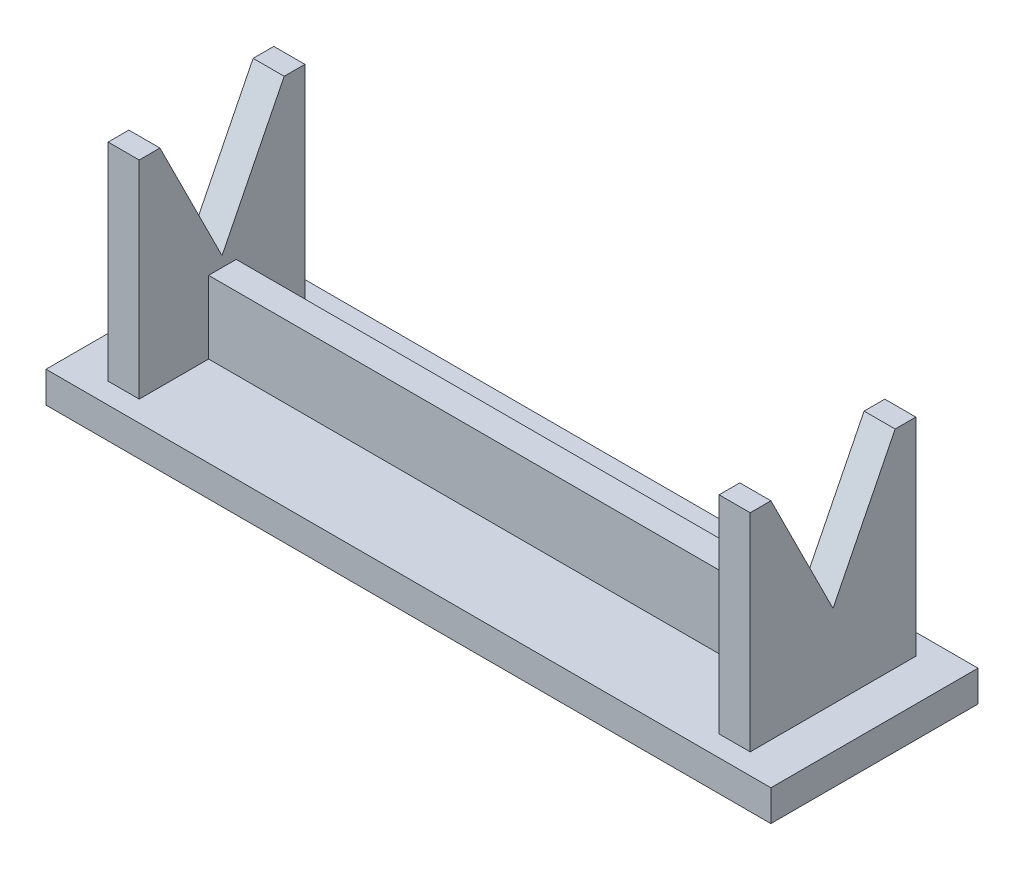
ISO-10303-21;
HEADER;
FILE_DESCRIPTION(('STEP AP214'),'2;1');
FILE_NAME('part.step','',(''),(''),'','','');
FILE_SCHEMA(('AUTOMOTIVE_DESIGN { 1 0 10303 214 1 1 1 1 }'));
ENDSEC;
DATA;
#1=APPLICATION_CONTEXT('core data for automotive mechanical design processes');
#2=APPLICATION_PROTOCOL_DEFINITION('international standard','automotive_design',2000,#1);
#3=PRODUCT_CONTEXT('',#1,'mechanical');
#4=PRODUCT('Part','Part','',(#3));
#5=PRODUCT_RELATED_PRODUCT_CATEGORY('part','',(#4));
#6=PRODUCT_DEFINITION_FORMATION('','',#4);
#7=PRODUCT_DEFINITION_CONTEXT('part definition',#1,'design');
#8=PRODUCT_DEFINITION('design','',#6,#7);
#9=PRODUCT_DEFINITION_SHAPE('','',#8);
#10=(LENGTH_UNIT() NAMED_UNIT(*) SI_UNIT(.MILLI.,.METRE.));
#11=(NAMED_UNIT(*) PLANE_ANGLE_UNIT() SI_UNIT($,.RADIAN.));
#12=(NAMED_UNIT(*) SI_UNIT($,.STERADIAN.) SOLID_ANGLE_UNIT());
#13=UNCERTAINTY_MEASURE_WITH_UNIT(LENGTH_MEASURE(1.E-05),#10,'distance_accuracy_value','');
#14=(GEOMETRIC_REPRESENTATION_CONTEXT(3) GLOBAL_UNCERTAINTY_ASSIGNED_CONTEXT((#13)) GLOBAL_UNIT_ASSIGNED_CONTEXT((#10,
#11,#12)) REPRESENTATION_CONTEXT('',''));
#15=CARTESIAN_POINT('',(0.,0.,0.));
#16=DIRECTION('',(0.,0.,1.));
#17=DIRECTION('',(1.,0.,0.));
#18=AXIS2_PLACEMENT_3D('',#15,#16,#17);
#19=CARTESIAN_POINT('',(0.,3.,0.));
#20=DIRECTION('',(0.,-1.,0.));
#21=DIRECTION('',(0.,0.,-1.));
#22=AXIS2_PLACEMENT_3D('',#19,#20,#21);
#23=PLANE('',#22);
#24=DIRECTION('',(0.,0.,1.));
#25=VECTOR('',#24,1.);
#26=CARTESIAN_POINT('',(0.,3.,0.));
#27=LINE('',#26,#25);
#28=CARTESIAN_POINT('',(0.,3.,-20.));
#29=VERTEX_POINT('',#28);
#30=CARTESIAN_POINT('',(0.,3.,0.));
#31=VERTEX_POINT('',#30);
#32=EDGE_CURVE('E363',#29,#31,#27,.T.);
#33=ORIENTED_EDGE('',*,*,#32,.T.);
#34=DIRECTION('',(1.,0.,0.));
#35=VECTOR('',#34,1.);
#36=CARTESIAN_POINT('',(0.,3.,0.));
#37=LINE('',#36,#35);
#38=CARTESIAN_POINT('',(70.,3.,0.));
#39=VERTEX_POINT('',#38);
#40=EDGE_CURVE('E367',#31,#39,#37,.T.);
#41=ORIENTED_EDGE('',*,*,#40,.T.);
#42=DIRECTION('',(0.,0.,-1.));
#43=VECTOR('',#42,1.);
#44=CARTESIAN_POINT('',(70.,3.,0.));
#45=LINE('',#44,#43);
#46=CARTESIAN_POINT('',(70.,3.,-20.));
#47=VERTEX_POINT('',#46);
#48=EDGE_CURVE('E371',#39,#47,#45,.T.);
#49=ORIENTED_EDGE('',*,*,#48,.T.);
#50=DIRECTION('',(-1.,0.,0.));
#51=VECTOR('',#50,1.);
#52=CARTESIAN_POINT('',(0.,3.,-20.));
#53=LINE('',#52,#51);
#54=EDGE_CURVE('E374',#47,#29,#53,.T.);
#55=ORIENTED_EDGE('',*,*,#54,.T.);
#56=EDGE_LOOP('',(#33,#41,#49,#55));
#57=FACE_BOUND('',#56,.T.);
#58=DIRECTION('',(1.,0.,0.));
#59=VECTOR('',#58,1.);
#60=CARTESIAN_POINT('',(6.99999999999998,3.,-8.7034388832141));
#61=LINE('',#60,#59);
#62=CARTESIAN_POINT('',(6.99999999999998,3.,-8.7034388832141));
#63=VERTEX_POINT('',#62);
#64=CARTESIAN_POINT('',(63.,3.,-8.7034388832141));
#65=VERTEX_POINT('',#64);
#66=EDGE_CURVE('E660',#63,#65,#61,.T.);
#67=ORIENTED_EDGE('',*,*,#66,.F.);
#68=DIRECTION('',(0.,0.,-1.));
#69=VECTOR('',#68,1.);
#70=CARTESIAN_POINT('',(6.99999999999998,3.,-18.));
#71=LINE('',#70,#69);
#72=CARTESIAN_POINT('',(6.99999999999998,3.,-2.));
#73=VERTEX_POINT('',#72);
#74=EDGE_CURVE('E212',#73,#63,#71,.T.);
#75=ORIENTED_EDGE('',*,*,#74,.F.);
#76=DIRECTION('',(1.,0.,0.));
#77=VECTOR('',#76,1.);
#78=CARTESIAN_POINT('',(3.99999999999999,3.,-2.));
#79=LINE('',#78,#77);
#80=CARTESIAN_POINT('',(3.99999999999999,3.,-2.));
#81=VERTEX_POINT('',#80);
#82=EDGE_CURVE('E337',#81,#73,#79,.T.);
#83=ORIENTED_EDGE('',*,*,#82,.F.);
#84=DIRECTION('',(0.,0.,1.));
#85=VECTOR('',#84,1.);
#86=CARTESIAN_POINT('',(3.99999999999999,3.,-18.));
#87=LINE('',#86,#85);
#88=CARTESIAN_POINT('',(3.99999999999999,3.,-18.));
#89=VERTEX_POINT('',#88);
#90=EDGE_CURVE('E316',#89,#81,#87,.T.);
#91=ORIENTED_EDGE('',*,*,#90,.F.);
#92=DIRECTION('',(-1.,0.,0.));
#93=VECTOR('',#92,1.);
#94=CARTESIAN_POINT('',(3.99999999999999,3.,-18.));
#95=LINE('',#94,#93);
#96=CARTESIAN_POINT('',(6.99999999999998,3.,-18.));
#97=VERTEX_POINT('',#96);
#98=EDGE_CURVE('E344',#97,#89,#95,.T.);
#99=ORIENTED_EDGE('',*,*,#98,.F.);
#100=CARTESIAN_POINT('',(6.99999999999998,3.,-11.3685922899405));
#101=VERTEX_POINT('',#100);
#102=EDGE_CURVE('E341',#101,#97,#71,.T.);
#103=ORIENTED_EDGE('',*,*,#102,.F.);
#104=DIRECTION('',(-1.,0.,0.));
#105=VECTOR('',#104,1.);
#106=CARTESIAN_POINT('',(6.99999999999998,3.,-11.3685922899405));
#107=LINE('',#106,#105);
#108=CARTESIAN_POINT('',(63.,3.,-11.3685922899405));
#109=VERTEX_POINT('',#108);
#110=EDGE_CURVE('E207',#109,#101,#107,.T.);
#111=ORIENTED_EDGE('',*,*,#110,.F.);
#112=DIRECTION('',(0.,0.,1.));
#113=VECTOR('',#112,1.);
#114=CARTESIAN_POINT('',(63.,3.,-18.));
#115=LINE('',#114,#113);
#116=CARTESIAN_POINT('',(63.,3.,-18.));
#117=VERTEX_POINT('',#116);
#118=EDGE_CURVE('E260',#117,#109,#115,.T.);
#119=ORIENTED_EDGE('',*,*,#118,.F.);
#120=DIRECTION('',(-1.,0.,0.));
#121=VECTOR('',#120,1.);
#122=CARTESIAN_POINT('',(63.,3.,-18.));
#123=LINE('',#122,#121);
#124=CARTESIAN_POINT('',(66.,3.,-18.));
#125=VERTEX_POINT('',#124);
#126=EDGE_CURVE('E272',#125,#117,#123,.T.);
#127=ORIENTED_EDGE('',*,*,#126,.F.);
#128=DIRECTION('',(0.,0.,-1.));
#129=VECTOR('',#128,1.);
#130=CARTESIAN_POINT('',(66.,3.,-18.));
#131=LINE('',#130,#129);
#132=CARTESIAN_POINT('',(66.,3.,-2.));
#133=VERTEX_POINT('',#132);
#134=EDGE_CURVE('E268',#133,#125,#131,.T.);
#135=ORIENTED_EDGE('',*,*,#134,.F.);
#136=DIRECTION('',(1.,0.,0.));
#137=VECTOR('',#136,1.);
#138=CARTESIAN_POINT('',(63.,3.,-2.));
#139=LINE('',#138,#137);
#140=CARTESIAN_POINT('',(63.,3.,-2.));
#141=VERTEX_POINT('',#140);
#142=EDGE_CURVE('E264',#141,#133,#139,.T.);
#143=ORIENTED_EDGE('',*,*,#142,.F.);
#144=EDGE_CURVE('E242',#65,#141,#115,.T.);
#145=ORIENTED_EDGE('',*,*,#144,.F.);
#146=EDGE_LOOP('',(#67,#75,#83,#91,#99,#103,#111,#119,#127,#135,#143,#145));
#147=FACE_BOUND('',#146,.T.);
#148=ADVANCED_FACE('F39',(#57,#147),#23,.F.);
#149=CARTESIAN_POINT('',(6.99999999999998,23.,-18.));
#150=DIRECTION('',(-1.,0.,0.));
#151=DIRECTION('',(0.,0.,1.));
#152=AXIS2_PLACEMENT_3D('',#149,#150,#151);
#153=PLANE('',#152);
#154=DIRECTION('',(0.,-1.,0.));
#155=VECTOR('',#154,1.);
#156=CARTESIAN_POINT('',(6.99999999999998,10.,-8.7034388832141));
#157=LINE('',#156,#155);
#158=CARTESIAN_POINT('',(6.99999999999998,10.,-8.7034388832141));
#159=VERTEX_POINT('',#158);
#160=EDGE_CURVE('E191',#159,#63,#157,.T.);
#161=ORIENTED_EDGE('',*,*,#160,.F.);
#162=DIRECTION('',(0.,0.,1.));
#163=VECTOR('',#162,1.);
#164=CARTESIAN_POINT('',(6.99999999999998,10.,-11.3685922899405));
#165=LINE('',#164,#163);
#166=CARTESIAN_POINT('',(6.99999999999998,10.,-11.3685922899405));
#167=VERTEX_POINT('',#166);
#168=EDGE_CURVE('E197',#167,#159,#165,.T.);
#169=ORIENTED_EDGE('',*,*,#168,.F.);
#170=DIRECTION('',(0.,-1.,0.));
#171=VECTOR('',#170,1.);
#172=CARTESIAN_POINT('',(6.99999999999998,10.,-11.3685922899405));
#173=LINE('',#172,#171);
#174=EDGE_CURVE('E669',#167,#101,#173,.T.);
#175=ORIENTED_EDGE('',*,*,#174,.T.);
#176=ORIENTED_EDGE('',*,*,#102,.T.);
#177=DIRECTION('',(0.,-1.,0.));
#178=VECTOR('',#177,1.);
#179=CARTESIAN_POINT('',(6.99999999999998,23.,-18.));
#180=LINE('',#179,#178);
#181=CARTESIAN_POINT('',(6.99999999999998,23.,-18.));
#182=VERTEX_POINT('',#181);
#183=EDGE_CURVE('E351',#182,#97,#180,.T.);
#184=ORIENTED_EDGE('',*,*,#183,.F.);
#185=DIRECTION('',(0.,0.,-1.));
#186=VECTOR('',#185,1.);
#187=CARTESIAN_POINT('',(6.99999999999998,23.,-18.));
#188=LINE('',#187,#186);
#189=CARTESIAN_POINT('',(6.99999999999998,23.,-16.));
#190=VERTEX_POINT('',#189);
#191=EDGE_CURVE('E325',#190,#182,#188,.T.);
#192=ORIENTED_EDGE('',*,*,#191,.F.);
#193=DIRECTION('',(0.,0.894427190999916,-0.447213595499958));
#194=VECTOR('',#193,1.);
#195=CARTESIAN_POINT('',(6.99999999999999,23.,-16.));
#196=LINE('',#195,#194);
#197=CARTESIAN_POINT('',(6.99999999999999,11.,-10.));
#198=VERTEX_POINT('',#197);
#199=EDGE_CURVE('E296',#198,#190,#196,.T.);
#200=ORIENTED_EDGE('',*,*,#199,.F.);
#201=DIRECTION('',(0.,-0.894427190999916,-0.447213595499958));
#202=VECTOR('',#201,1.);
#203=CARTESIAN_POINT('',(6.99999999999999,11.,-10.));
#204=LINE('',#203,#202);
#205=CARTESIAN_POINT('',(6.99999999999999,23.,-4.));
#206=VERTEX_POINT('',#205);
#207=EDGE_CURVE('E292',#206,#198,#204,.T.);
#208=ORIENTED_EDGE('',*,*,#207,.F.);
#209=CARTESIAN_POINT('',(6.99999999999998,23.,-2.));
#210=VERTEX_POINT('',#209);
#211=EDGE_CURVE('E326',#210,#206,#188,.T.);
#212=ORIENTED_EDGE('',*,*,#211,.F.);
#213=DIRECTION('',(0.,-1.,0.));
#214=VECTOR('',#213,1.);
#215=CARTESIAN_POINT('',(6.99999999999998,23.,-2.));
#216=LINE('',#215,#214);
#217=EDGE_CURVE('E355',#210,#73,#216,.T.);
#218=ORIENTED_EDGE('',*,*,#217,.T.);
#219=ORIENTED_EDGE('',*,*,#74,.T.);
#220=EDGE_LOOP('',(#161,#169,#175,#176,#184,#192,#200,#208,#212,#218,#219));
#221=FACE_BOUND('',#220,.T.);
#222=ADVANCED_FACE('F210',(#221),#153,.F.);
#223=CARTESIAN_POINT('',(63.,23.,-18.));
#224=DIRECTION('',(1.,0.,0.));
#225=DIRECTION('',(0.,0.,-1.));
#226=AXIS2_PLACEMENT_3D('',#223,#224,#225);
#227=PLANE('',#226);
#228=DIRECTION('',(0.,-1.,0.));
#229=VECTOR('',#228,1.);
#230=CARTESIAN_POINT('',(63.,10.,-8.7034388832141));
#231=LINE('',#230,#229);
#232=CARTESIAN_POINT('',(63.,10.,-8.7034388832141));
#233=VERTEX_POINT('',#232);
#234=EDGE_CURVE('E55',#233,#65,#231,.T.);
#235=ORIENTED_EDGE('',*,*,#234,.T.);
#236=ORIENTED_EDGE('',*,*,#144,.T.);
#237=DIRECTION('',(0.,-1.,0.));
#238=VECTOR('',#237,1.);
#239=CARTESIAN_POINT('',(63.,23.,-2.));
#240=LINE('',#239,#238);
#241=CARTESIAN_POINT('',(63.,23.,-2.));
#242=VERTEX_POINT('',#241);
#243=EDGE_CURVE('E287',#242,#141,#240,.T.);
#244=ORIENTED_EDGE('',*,*,#243,.F.);
#245=DIRECTION('',(0.,0.,1.));
#246=VECTOR('',#245,1.);
#247=CARTESIAN_POINT('',(63.,23.,-18.));
#248=LINE('',#247,#246);
#249=CARTESIAN_POINT('',(63.,23.,-4.));
#250=VERTEX_POINT('',#249);
#251=EDGE_CURVE('E248',#250,#242,#248,.T.);
#252=ORIENTED_EDGE('',*,*,#251,.F.);
#253=DIRECTION('',(0.,-0.894427190999916,-0.447213595499958));
#254=VECTOR('',#253,1.);
#255=CARTESIAN_POINT('',(63.,11.,-10.));
#256=LINE('',#255,#254);
#257=CARTESIAN_POINT('',(63.,11.,-10.));
#258=VERTEX_POINT('',#257);
#259=EDGE_CURVE('E214',#250,#258,#256,.T.);
#260=ORIENTED_EDGE('',*,*,#259,.T.);
#261=DIRECTION('',(0.,0.894427190999916,-0.447213595499958));
#262=VECTOR('',#261,1.);
#263=CARTESIAN_POINT('',(63.,23.,-16.));
#264=LINE('',#263,#262);
#265=CARTESIAN_POINT('',(63.,23.,-16.));
#266=VERTEX_POINT('',#265);
#267=EDGE_CURVE('E219',#258,#266,#264,.T.);
#268=ORIENTED_EDGE('',*,*,#267,.T.);
#269=CARTESIAN_POINT('',(63.,23.,-18.));
#270=VERTEX_POINT('',#269);
#271=EDGE_CURVE('E243',#270,#266,#248,.T.);
#272=ORIENTED_EDGE('',*,*,#271,.F.);
#273=DIRECTION('',(0.,-1.,0.));
#274=VECTOR('',#273,1.);
#275=CARTESIAN_POINT('',(63.,23.,-18.));
#276=LINE('',#275,#274);
#277=EDGE_CURVE('E259',#270,#117,#276,.T.);
#278=ORIENTED_EDGE('',*,*,#277,.T.);
#279=ORIENTED_EDGE('',*,*,#118,.T.);
#280=DIRECTION('',(0.,-1.,0.));
#281=VECTOR('',#280,1.);
#282=CARTESIAN_POINT('',(63.,10.,-11.3685922899405));
#283=LINE('',#282,#281);
#284=CARTESIAN_POINT('',(63.,10.,-11.3685922899405));
#285=VERTEX_POINT('',#284);
#286=EDGE_CURVE('E221',#285,#109,#283,.T.);
#287=ORIENTED_EDGE('',*,*,#286,.F.);
#288=DIRECTION('',(0.,0.,-1.));
#289=VECTOR('',#288,1.);
#290=CARTESIAN_POINT('',(63.,10.,-11.3685922899405));
#291=LINE('',#290,#289);
#292=EDGE_CURVE('E196',#233,#285,#291,.T.);
#293=ORIENTED_EDGE('',*,*,#292,.F.);
#294=EDGE_LOOP('',(#235,#236,#244,#252,#260,#268,#272,#278,#279,#287,#293));
#295=FACE_BOUND('',#294,.T.);
#296=ADVANCED_FACE('F430',(#295),#227,.F.);
#297=CARTESIAN_POINT('',(66.,23.,-18.));
#298=DIRECTION('',(-1.,0.,0.));
#299=DIRECTION('',(0.,0.,1.));
#300=AXIS2_PLACEMENT_3D('',#297,#298,#299);
#301=PLANE('',#300);
#302=DIRECTION('',(0.,0.894427190999916,-0.447213595499958));
#303=VECTOR('',#302,1.);
#304=CARTESIAN_POINT('',(66.,23.,-16.));
#305=LINE('',#304,#303);
#306=CARTESIAN_POINT('',(66.,11.,-10.));
#307=VERTEX_POINT('',#306);
#308=CARTESIAN_POINT('',(66.,23.,-16.));
#309=VERTEX_POINT('',#308);
#310=EDGE_CURVE('E63',#307,#309,#305,.T.);
#311=ORIENTED_EDGE('',*,*,#310,.F.);
#312=DIRECTION('',(0.,-0.894427190999916,-0.447213595499958));
#313=VECTOR('',#312,1.);
#314=CARTESIAN_POINT('',(66.,11.,-10.));
#315=LINE('',#314,#313);
#316=CARTESIAN_POINT('',(66.,23.,-4.));
#317=VERTEX_POINT('',#316);
#318=EDGE_CURVE('E225',#317,#307,#315,.T.);
#319=ORIENTED_EDGE('',*,*,#318,.F.);
#320=DIRECTION('',(0.,0.,-1.));
#321=VECTOR('',#320,1.);
#322=CARTESIAN_POINT('',(66.,23.,-18.));
#323=LINE('',#322,#321);
#324=CARTESIAN_POINT('',(66.,23.,-2.));
#325=VERTEX_POINT('',#324);
#326=EDGE_CURVE('E252',#325,#317,#323,.T.);
#327=ORIENTED_EDGE('',*,*,#326,.F.);
#328=DIRECTION('',(0.,-1.,0.));
#329=VECTOR('',#328,1.);
#330=CARTESIAN_POINT('',(66.,23.,-2.));
#331=LINE('',#330,#329);
#332=EDGE_CURVE('E283',#325,#133,#331,.T.);
#333=ORIENTED_EDGE('',*,*,#332,.T.);
#334=ORIENTED_EDGE('',*,*,#134,.T.);
#335=DIRECTION('',(0.,-1.,0.));
#336=VECTOR('',#335,1.);
#337=CARTESIAN_POINT('',(66.,23.,-18.));
#338=LINE('',#337,#336);
#339=CARTESIAN_POINT('',(66.,23.,-18.));
#340=VERTEX_POINT('',#339);
#341=EDGE_CURVE('E279',#340,#125,#338,.T.);
#342=ORIENTED_EDGE('',*,*,#341,.F.);
#343=EDGE_CURVE('E251',#309,#340,#323,.T.);
#344=ORIENTED_EDGE('',*,*,#343,.F.);
#345=EDGE_LOOP('',(#311,#319,#327,#333,#334,#342,#344));
#346=FACE_BOUND('',#345,.T.);
#347=ADVANCED_FACE('F577',(#346),#301,.F.);
#348=CARTESIAN_POINT('',(0.,23.,0.));
#349=DIRECTION('',(0.,1.,0.));
#350=DIRECTION('',(0.,0.,1.));
#351=AXIS2_PLACEMENT_3D('',#348,#349,#350);
#352=PLANE('',#351);
#353=ORIENTED_EDGE('',*,*,#271,.T.);
#354=DIRECTION('',(1.,0.,0.));
#355=VECTOR('',#354,1.);
#356=CARTESIAN_POINT('',(-111.184859983132,23.,-16.));
#357=LINE('',#356,#355);
#358=EDGE_CURVE('E228',#266,#309,#357,.T.);
#359=ORIENTED_EDGE('',*,*,#358,.T.);
#360=ORIENTED_EDGE('',*,*,#343,.T.);
#361=DIRECTION('',(-1.,0.,0.));
#362=VECTOR('',#361,1.);
#363=CARTESIAN_POINT('',(63.,23.,-18.));
#364=LINE('',#363,#362);
#365=EDGE_CURVE('E256',#340,#270,#364,.T.);
#366=ORIENTED_EDGE('',*,*,#365,.T.);
#367=EDGE_LOOP('',(#353,#359,#360,#366));
#368=FACE_BOUND('',#367,.T.);
#369=ADVANCED_FACE('F520',(#368),#352,.T.);
#370=CARTESIAN_POINT('',(0.,23.,0.));
#371=DIRECTION('',(0.,1.,0.));
#372=DIRECTION('',(0.,0.,1.));
#373=AXIS2_PLACEMENT_3D('',#370,#371,#372);
#374=PLANE('',#373);
#375=DIRECTION('',(0.,0.,1.));
#376=VECTOR('',#375,1.);
#377=CARTESIAN_POINT('',(3.99999999999999,23.,-18.));
#378=LINE('',#377,#376);
#379=CARTESIAN_POINT('',(3.99999999999999,23.,-18.));
#380=VERTEX_POINT('',#379);
#381=CARTESIAN_POINT('',(3.99999999999999,23.,-16.));
#382=VERTEX_POINT('',#381);
#383=EDGE_CURVE('E317',#380,#382,#378,.T.);
#384=ORIENTED_EDGE('',*,*,#383,.T.);
#385=DIRECTION('',(1.,0.,0.));
#386=VECTOR('',#385,1.);
#387=CARTESIAN_POINT('',(-96.434859983132,23.,-16.));
#388=LINE('',#387,#386);
#389=EDGE_CURVE('E295',#382,#190,#388,.T.);
#390=ORIENTED_EDGE('',*,*,#389,.T.);
#391=ORIENTED_EDGE('',*,*,#191,.T.);
#392=DIRECTION('',(-1.,0.,0.));
#393=VECTOR('',#392,1.);
#394=CARTESIAN_POINT('',(3.99999999999999,23.,-18.));
#395=LINE('',#394,#393);
#396=EDGE_CURVE('E330',#182,#380,#395,.T.);
#397=ORIENTED_EDGE('',*,*,#396,.T.);
#398=EDGE_LOOP('',(#384,#390,#391,#397));
#399=FACE_BOUND('',#398,.T.);
#400=ADVANCED_FACE('F424',(#399),#374,.T.);
#401=CARTESIAN_POINT('',(0.,3.,0.));
#402=DIRECTION('',(1.,0.,0.));
#403=DIRECTION('',(0.,0.,-1.));
#404=AXIS2_PLACEMENT_3D('',#401,#402,#403);
#405=PLANE('',#404);
#406=DIRECTION('',(0.,0.,1.));
#407=VECTOR('',#406,1.);
#408=CARTESIAN_POINT('',(0.,0.,0.));
#409=LINE('',#408,#407);
#410=CARTESIAN_POINT('',(0.,0.,-20.));
#411=VERTEX_POINT('',#410);
#412=CARTESIAN_POINT('',(0.,0.,0.));
#413=VERTEX_POINT('',#412);
#414=EDGE_CURVE('E362',#411,#413,#409,.T.);
#415=ORIENTED_EDGE('',*,*,#414,.T.);
#416=DIRECTION('',(0.,-1.,0.));
#417=VECTOR('',#416,1.);
#418=CARTESIAN_POINT('',(0.,3.,0.));
#419=LINE('',#418,#417);
#420=EDGE_CURVE('E11',#31,#413,#419,.T.);
#421=ORIENTED_EDGE('',*,*,#420,.F.);
#422=ORIENTED_EDGE('',*,*,#32,.F.);
#423=DIRECTION('',(0.,-1.,0.));
#424=VECTOR('',#423,1.);
#425=CARTESIAN_POINT('',(0.,3.,-20.));
#426=LINE('',#425,#424);
#427=EDGE_CURVE('E377',#29,#411,#426,.T.);
#428=ORIENTED_EDGE('',*,*,#427,.T.);
#429=EDGE_LOOP('',(#415,#421,#422,#428));
#430=FACE_BOUND('',#429,.T.);
#431=ADVANCED_FACE('F41',(#430),#405,.F.);
#432=CARTESIAN_POINT('',(0.,3.,0.));
#433=DIRECTION('',(0.,0.,-1.));
#434=DIRECTION('',(-1.,0.,0.));
#435=AXIS2_PLACEMENT_3D('',#432,#433,#434);
#436=PLANE('',#435);
#437=DIRECTION('',(1.,0.,0.));
#438=VECTOR('',#437,1.);
#439=CARTESIAN_POINT('',(0.,0.,0.));
#440=LINE('',#439,#438);
#441=CARTESIAN_POINT('',(70.,0.,0.));
#442=VERTEX_POINT('',#441);
#443=EDGE_CURVE('E381',#413,#442,#440,.T.);
#444=ORIENTED_EDGE('',*,*,#443,.T.);
#445=DIRECTION('',(0.,-1.,0.));
#446=VECTOR('',#445,1.);
#447=CARTESIAN_POINT('',(70.,3.,0.));
#448=LINE('',#447,#446);
#449=EDGE_CURVE('E48',#39,#442,#448,.T.);
#450=ORIENTED_EDGE('',*,*,#449,.F.);
#451=ORIENTED_EDGE('',*,*,#40,.F.);
#452=ORIENTED_EDGE('',*,*,#420,.T.);
#453=EDGE_LOOP('',(#444,#450,#451,#452));
#454=FACE_BOUND('',#453,.T.);
#455=ADVANCED_FACE('F417',(#454),#436,.F.);
#456=CARTESIAN_POINT('',(70.,3.,0.));
#457=DIRECTION('',(-1.,0.,0.));
#458=DIRECTION('',(0.,0.,1.));
#459=AXIS2_PLACEMENT_3D('',#456,#457,#458);
#460=PLANE('',#459);
#461=DIRECTION('',(0.,0.,-1.));
#462=VECTOR('',#461,1.);
#463=CARTESIAN_POINT('',(70.,0.,0.));
#464=LINE('',#463,#462);
#465=CARTESIAN_POINT('',(70.,0.,-20.));
#466=VERTEX_POINT('',#465);
#467=EDGE_CURVE('E384',#442,#466,#464,.T.);
#468=ORIENTED_EDGE('',*,*,#467,.T.);
#469=DIRECTION('',(0.,-1.,0.));
#470=VECTOR('',#469,1.);
#471=CARTESIAN_POINT('',(70.,3.,-20.));
#472=LINE('',#471,#470);
#473=EDGE_CURVE('E392',#47,#466,#472,.T.);
#474=ORIENTED_EDGE('',*,*,#473,.F.);
#475=ORIENTED_EDGE('',*,*,#48,.F.);
#476=ORIENTED_EDGE('',*,*,#449,.T.);
#477=EDGE_LOOP('',(#468,#474,#475,#476));
#478=FACE_BOUND('',#477,.T.);
#479=ADVANCED_FACE('F401',(#478),#460,.F.);
#480=CARTESIAN_POINT('',(0.,3.,-20.));
#481=DIRECTION('',(0.,0.,1.));
#482=DIRECTION('',(1.,0.,0.));
#483=AXIS2_PLACEMENT_3D('',#480,#481,#482);
#484=PLANE('',#483);
#485=DIRECTION('',(-1.,0.,0.));
#486=VECTOR('',#485,1.);
#487=CARTESIAN_POINT('',(0.,0.,-20.));
#488=LINE('',#487,#486);
#489=EDGE_CURVE('E368',#466,#411,#488,.T.);
#490=ORIENTED_EDGE('',*,*,#489,.T.);
#491=ORIENTED_EDGE('',*,*,#427,.F.);
#492=ORIENTED_EDGE('',*,*,#54,.F.);
#493=ORIENTED_EDGE('',*,*,#473,.T.);
#494=EDGE_LOOP('',(#490,#491,#492,#493));
#495=FACE_BOUND('',#494,.T.);
#496=ADVANCED_FACE('F410',(#495),#484,.F.);
#497=CARTESIAN_POINT('',(0.,0.,0.));
#498=DIRECTION('',(0.,-1.,0.));
#499=DIRECTION('',(0.,0.,-1.));
#500=AXIS2_PLACEMENT_3D('',#497,#498,#499);
#501=PLANE('',#500);
#502=ORIENTED_EDGE('',*,*,#414,.F.);
#503=ORIENTED_EDGE('',*,*,#489,.F.);
#504=ORIENTED_EDGE('',*,*,#467,.F.);
#505=ORIENTED_EDGE('',*,*,#443,.F.);
#506=EDGE_LOOP('',(#502,#503,#504,#505));
#507=FACE_BOUND('',#506,.T.);
#508=ADVANCED_FACE('F407',(#507),#501,.T.);
#509=CARTESIAN_POINT('',(3.99999999999999,23.,-18.));
#510=DIRECTION('',(1.,0.,0.));
#511=DIRECTION('',(0.,0.,-1.));
#512=AXIS2_PLACEMENT_3D('',#509,#510,#511);
#513=PLANE('',#512);
#514=CARTESIAN_POINT('',(3.99999999999999,23.,-4.));
#515=VERTEX_POINT('',#514);
#516=CARTESIAN_POINT('',(3.99999999999999,23.,-2.));
#517=VERTEX_POINT('',#516);
#518=EDGE_CURVE('E322',#515,#517,#378,.T.);
#519=ORIENTED_EDGE('',*,*,#518,.F.);
#520=DIRECTION('',(0.,-0.894427190999916,-0.447213595499958));
#521=VECTOR('',#520,1.);
#522=CARTESIAN_POINT('',(3.99999999999999,11.,-10.));
#523=LINE('',#522,#521);
#524=CARTESIAN_POINT('',(3.99999999999999,11.,-10.));
#525=VERTEX_POINT('',#524);
#526=EDGE_CURVE('E291',#515,#525,#523,.T.);
#527=ORIENTED_EDGE('',*,*,#526,.T.);
#528=DIRECTION('',(0.,0.894427190999916,-0.447213595499958));
#529=VECTOR('',#528,1.);
#530=CARTESIAN_POINT('',(3.99999999999999,23.,-16.));
#531=LINE('',#530,#529);
#532=EDGE_CURVE('E299',#525,#382,#531,.T.);
#533=ORIENTED_EDGE('',*,*,#532,.T.);
#534=ORIENTED_EDGE('',*,*,#383,.F.);
#535=DIRECTION('',(0.,-1.,0.));
#536=VECTOR('',#535,1.);
#537=CARTESIAN_POINT('',(3.99999999999999,23.,-18.));
#538=LINE('',#537,#536);
#539=EDGE_CURVE('E333',#380,#89,#538,.T.);
#540=ORIENTED_EDGE('',*,*,#539,.T.);
#541=ORIENTED_EDGE('',*,*,#90,.T.);
#542=DIRECTION('',(0.,-1.,0.));
#543=VECTOR('',#542,1.);
#544=CARTESIAN_POINT('',(3.99999999999999,23.,-2.));
#545=LINE('',#544,#543);
#546=EDGE_CURVE('E358',#517,#81,#545,.T.);
#547=ORIENTED_EDGE('',*,*,#546,.F.);
#548=EDGE_LOOP('',(#519,#527,#533,#534,#540,#541,#547));
#549=FACE_BOUND('',#548,.T.);
#550=ADVANCED_FACE('F434',(#549),#513,.F.);
#551=CARTESIAN_POINT('',(3.99999999999999,23.,-2.));
#552=DIRECTION('',(0.,0.,-1.));
#553=DIRECTION('',(-1.,0.,0.));
#554=AXIS2_PLACEMENT_3D('',#551,#552,#553);
#555=PLANE('',#554);
#556=ORIENTED_EDGE('',*,*,#82,.T.);
#557=ORIENTED_EDGE('',*,*,#217,.F.);
#558=DIRECTION('',(1.,0.,0.));
#559=VECTOR('',#558,1.);
#560=CARTESIAN_POINT('',(3.99999999999999,23.,-2.));
#561=LINE('',#560,#559);
#562=EDGE_CURVE('E321',#517,#210,#561,.T.);
#563=ORIENTED_EDGE('',*,*,#562,.F.);
#564=ORIENTED_EDGE('',*,*,#546,.T.);
#565=EDGE_LOOP('',(#556,#557,#563,#564));
#566=FACE_BOUND('',#565,.T.);
#567=ADVANCED_FACE('F454',(#566),#555,.F.);
#568=CARTESIAN_POINT('',(3.99999999999999,23.,-18.));
#569=DIRECTION('',(0.,0.,1.));
#570=DIRECTION('',(1.,0.,0.));
#571=AXIS2_PLACEMENT_3D('',#568,#569,#570);
#572=PLANE('',#571);
#573=ORIENTED_EDGE('',*,*,#98,.T.);
#574=ORIENTED_EDGE('',*,*,#539,.F.);
#575=ORIENTED_EDGE('',*,*,#396,.F.);
#576=ORIENTED_EDGE('',*,*,#183,.T.);
#577=EDGE_LOOP('',(#573,#574,#575,#576));
#578=FACE_BOUND('',#577,.T.);
#579=ADVANCED_FACE('F462',(#578),#572,.F.);
#580=DIRECTION('',(1.,0.,0.));
#581=VECTOR('',#580,1.);
#582=CARTESIAN_POINT('',(-96.434859983132,23.,-4.));
#583=LINE('',#582,#581);
#584=EDGE_CURVE('E309',#515,#206,#583,.T.);
#585=ORIENTED_EDGE('',*,*,#584,.F.);
#586=ORIENTED_EDGE('',*,*,#518,.T.);
#587=ORIENTED_EDGE('',*,*,#562,.T.);
#588=ORIENTED_EDGE('',*,*,#211,.T.);
#589=EDGE_LOOP('',(#585,#586,#587,#588));
#590=FACE_BOUND('',#589,.T.);
#591=ADVANCED_FACE('F469',(#590),#374,.T.);
#592=CARTESIAN_POINT('',(-96.434859983132,11.,-10.));
#593=DIRECTION('',(0.,0.447213595499958,-0.894427190999916));
#594=DIRECTION('',(0.,0.894427190999916,0.447213595499958));
#595=AXIS2_PLACEMENT_3D('',#592,#593,#594);
#596=PLANE('',#595);
#597=ORIENTED_EDGE('',*,*,#526,.F.);
#598=ORIENTED_EDGE('',*,*,#584,.T.);
#599=ORIENTED_EDGE('',*,*,#207,.T.);
#600=DIRECTION('',(1.,0.,0.));
#601=VECTOR('',#600,1.);
#602=CARTESIAN_POINT('',(-96.434859983132,11.,-10.));
#603=LINE('',#602,#601);
#604=EDGE_CURVE('E312',#525,#198,#603,.T.);
#605=ORIENTED_EDGE('',*,*,#604,.F.);
#606=EDGE_LOOP('',(#597,#598,#599,#605));
#607=FACE_BOUND('',#606,.T.);
#608=ADVANCED_FACE('F476',(#607),#596,.T.);
#609=CARTESIAN_POINT('',(-96.434859983132,23.,-16.));
#610=DIRECTION('',(0.,0.447213595499958,0.894427190999916));
#611=DIRECTION('',(0.,-0.894427190999916,0.447213595499958));
#612=AXIS2_PLACEMENT_3D('',#609,#610,#611);
#613=PLANE('',#612);
#614=ORIENTED_EDGE('',*,*,#532,.F.);
#615=ORIENTED_EDGE('',*,*,#604,.T.);
#616=ORIENTED_EDGE('',*,*,#199,.T.);
#617=ORIENTED_EDGE('',*,*,#389,.F.);
#618=EDGE_LOOP('',(#614,#615,#616,#617));
#619=FACE_BOUND('',#618,.T.);
#620=ADVANCED_FACE('F484',(#619),#613,.T.);
#621=CARTESIAN_POINT('',(63.,23.,-2.));
#622=DIRECTION('',(0.,0.,-1.));
#623=DIRECTION('',(-1.,0.,0.));
#624=AXIS2_PLACEMENT_3D('',#621,#622,#623);
#625=PLANE('',#624);
#626=ORIENTED_EDGE('',*,*,#142,.T.);
#627=ORIENTED_EDGE('',*,*,#332,.F.);
#628=DIRECTION('',(1.,0.,0.));
#629=VECTOR('',#628,1.);
#630=CARTESIAN_POINT('',(63.,23.,-2.));
#631=LINE('',#630,#629);
#632=EDGE_CURVE('E247',#242,#325,#631,.T.);
#633=ORIENTED_EDGE('',*,*,#632,.F.);
#634=ORIENTED_EDGE('',*,*,#243,.T.);
#635=EDGE_LOOP('',(#626,#627,#633,#634));
#636=FACE_BOUND('',#635,.T.);
#637=ADVANCED_FACE('F492',(#636),#625,.F.);
#638=CARTESIAN_POINT('',(63.,23.,-18.));
#639=DIRECTION('',(0.,0.,1.));
#640=DIRECTION('',(1.,0.,0.));
#641=AXIS2_PLACEMENT_3D('',#638,#639,#640);
#642=PLANE('',#641);
#643=ORIENTED_EDGE('',*,*,#126,.T.);
#644=ORIENTED_EDGE('',*,*,#277,.F.);
#645=ORIENTED_EDGE('',*,*,#365,.F.);
#646=ORIENTED_EDGE('',*,*,#341,.T.);
#647=EDGE_LOOP('',(#643,#644,#645,#646));
#648=FACE_BOUND('',#647,.T.);
#649=ADVANCED_FACE('F500',(#648),#642,.F.);
#650=DIRECTION('',(1.,0.,0.));
#651=VECTOR('',#650,1.);
#652=CARTESIAN_POINT('',(-111.184859983132,23.,-4.));
#653=LINE('',#652,#651);
#654=EDGE_CURVE('E236',#250,#317,#653,.T.);
#655=ORIENTED_EDGE('',*,*,#654,.F.);
#656=ORIENTED_EDGE('',*,*,#251,.T.);
#657=ORIENTED_EDGE('',*,*,#632,.T.);
#658=ORIENTED_EDGE('',*,*,#326,.T.);
#659=EDGE_LOOP('',(#655,#656,#657,#658));
#660=FACE_BOUND('',#659,.T.);
#661=ADVANCED_FACE('F508',(#660),#352,.T.);
#662=CARTESIAN_POINT('',(-111.184859983132,11.,-10.));
#663=DIRECTION('',(0.,0.447213595499958,-0.894427190999916));
#664=DIRECTION('',(0.,0.894427190999916,0.447213595499958));
#665=AXIS2_PLACEMENT_3D('',#662,#663,#664);
#666=PLANE('',#665);
#667=ORIENTED_EDGE('',*,*,#259,.F.);
#668=ORIENTED_EDGE('',*,*,#654,.T.);
#669=ORIENTED_EDGE('',*,*,#318,.T.);
#670=DIRECTION('',(1.,0.,0.));
#671=VECTOR('',#670,1.);
#672=CARTESIAN_POINT('',(-111.184859983132,11.,-10.));
#673=LINE('',#672,#671);
#674=EDGE_CURVE('E239',#258,#307,#673,.T.);
#675=ORIENTED_EDGE('',*,*,#674,.F.);
#676=EDGE_LOOP('',(#667,#668,#669,#675));
#677=FACE_BOUND('',#676,.T.);
#678=ADVANCED_FACE('F517',(#677),#666,.T.);
#679=CARTESIAN_POINT('',(-111.184859983132,23.,-16.));
#680=DIRECTION('',(0.,0.447213595499958,0.894427190999916));
#681=DIRECTION('',(0.,-0.894427190999916,0.447213595499958));
#682=AXIS2_PLACEMENT_3D('',#679,#680,#681);
#683=PLANE('',#682);
#684=ORIENTED_EDGE('',*,*,#267,.F.);
#685=ORIENTED_EDGE('',*,*,#674,.T.);
#686=ORIENTED_EDGE('',*,*,#310,.T.);
#687=ORIENTED_EDGE('',*,*,#358,.F.);
#688=EDGE_LOOP('',(#684,#685,#686,#687));
#689=FACE_BOUND('',#688,.T.);
#690=ADVANCED_FACE('F527',(#689),#683,.T.);
#691=CARTESIAN_POINT('',(6.99999999999998,10.,-8.7034388832141));
#692=DIRECTION('',(0.,0.,-1.));
#693=DIRECTION('',(-1.,0.,0.));
#694=AXIS2_PLACEMENT_3D('',#691,#692,#693);
#695=PLANE('',#694);
#696=ORIENTED_EDGE('',*,*,#66,.T.);
#697=ORIENTED_EDGE('',*,*,#234,.F.);
#698=DIRECTION('',(1.,0.,0.));
#699=VECTOR('',#698,1.);
#700=CARTESIAN_POINT('',(6.99999999999998,10.,-8.7034388832141));
#701=LINE('',#700,#699);
#702=EDGE_CURVE('E187',#159,#233,#701,.T.);
#703=ORIENTED_EDGE('',*,*,#702,.F.);
#704=ORIENTED_EDGE('',*,*,#160,.T.);
#705=EDGE_LOOP('',(#696,#697,#703,#704));
#706=FACE_BOUND('',#705,.T.);
#707=ADVANCED_FACE('F189',(#706),#695,.F.);
#708=CARTESIAN_POINT('',(6.99999999999998,10.,-11.3685922899405));
#709=DIRECTION('',(0.,0.,1.));
#710=DIRECTION('',(1.,0.,0.));
#711=AXIS2_PLACEMENT_3D('',#708,#709,#710);
#712=PLANE('',#711);
#713=ORIENTED_EDGE('',*,*,#110,.T.);
#714=ORIENTED_EDGE('',*,*,#174,.F.);
#715=DIRECTION('',(-1.,0.,0.));
#716=VECTOR('',#715,1.);
#717=CARTESIAN_POINT('',(6.99999999999998,10.,-11.3685922899405));
#718=LINE('',#717,#716);
#719=EDGE_CURVE('E202',#285,#167,#718,.T.);
#720=ORIENTED_EDGE('',*,*,#719,.F.);
#721=ORIENTED_EDGE('',*,*,#286,.T.);
#722=EDGE_LOOP('',(#713,#714,#720,#721));
#723=FACE_BOUND('',#722,.T.);
#724=ADVANCED_FACE('F541',(#723),#712,.F.);
#725=CARTESIAN_POINT('',(0.,10.,0.));
#726=DIRECTION('',(0.,1.,0.));
#727=DIRECTION('',(0.,0.,1.));
#728=AXIS2_PLACEMENT_3D('',#725,#726,#727);
#729=PLANE('',#728);
#730=ORIENTED_EDGE('',*,*,#168,.T.);
#731=ORIENTED_EDGE('',*,*,#702,.T.);
#732=ORIENTED_EDGE('',*,*,#292,.T.);
#733=ORIENTED_EDGE('',*,*,#719,.T.);
#734=EDGE_LOOP('',(#730,#731,#732,#733));
#735=FACE_BOUND('',#734,.T.);
#736=ADVANCED_FACE('F200',(#735),#729,.T.);
#737=CLOSED_SHELL('',(#148,#222,#296,#347,#369,#400,#431,#455,#479,#496,#508,#550,#567,#579,
#591,#608,#620,#637,#649,#661,#678,#690,#707,#724,#736));
#738=MANIFOLD_SOLID_BREP('B2',#737);
#739=ADVANCED_BREP_SHAPE_REPRESENTATION('',(#18,#738),#14);
#740=SHAPE_DEFINITION_REPRESENTATION(#9,#739);
ENDSEC;
END-ISO-10303-21;
